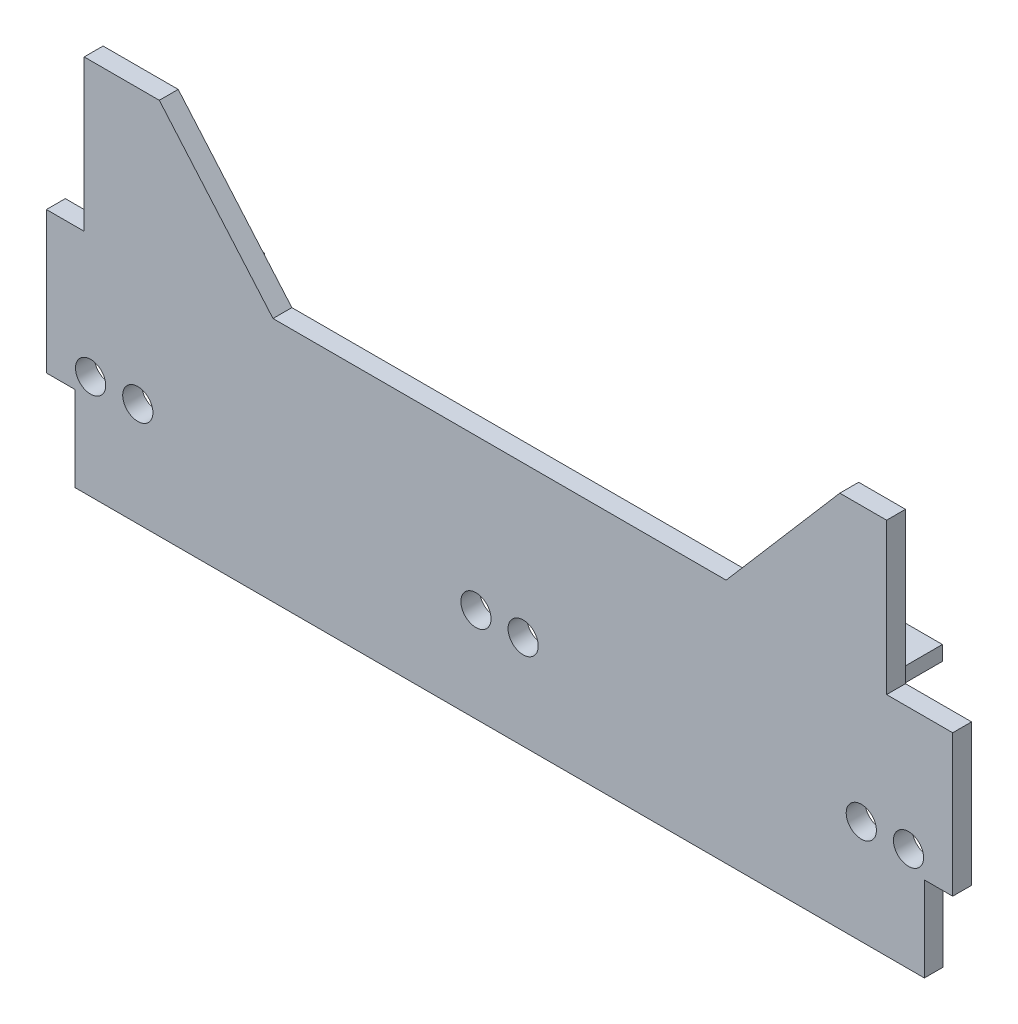
ISO-10303-21;
HEADER;
FILE_DESCRIPTION(('STEP AP214'),'2;1');
FILE_NAME('part.step','',(''),(''),'','','');
FILE_SCHEMA(('AUTOMOTIVE_DESIGN { 1 0 10303 214 1 1 1 1 }'));
ENDSEC;
DATA;
#1=APPLICATION_CONTEXT('core data for automotive mechanical design processes');
#2=APPLICATION_PROTOCOL_DEFINITION('international standard','automotive_design',2000,#1);
#3=PRODUCT_CONTEXT('',#1,'mechanical');
#4=PRODUCT('Part','Part','',(#3));
#5=PRODUCT_RELATED_PRODUCT_CATEGORY('part','',(#4));
#6=PRODUCT_DEFINITION_FORMATION('','',#4);
#7=PRODUCT_DEFINITION_CONTEXT('part definition',#1,'design');
#8=PRODUCT_DEFINITION('design','',#6,#7);
#9=PRODUCT_DEFINITION_SHAPE('','',#8);
#10=(LENGTH_UNIT() NAMED_UNIT(*) SI_UNIT(.MILLI.,.METRE.));
#11=(NAMED_UNIT(*) PLANE_ANGLE_UNIT() SI_UNIT($,.RADIAN.));
#12=(NAMED_UNIT(*) SI_UNIT($,.STERADIAN.) SOLID_ANGLE_UNIT());
#13=UNCERTAINTY_MEASURE_WITH_UNIT(LENGTH_MEASURE(1.E-05),#10,'distance_accuracy_value','');
#14=(GEOMETRIC_REPRESENTATION_CONTEXT(3) GLOBAL_UNCERTAINTY_ASSIGNED_CONTEXT((#13)) GLOBAL_UNIT_ASSIGNED_CONTEXT((#10,
#11,#12)) REPRESENTATION_CONTEXT('',''));
#15=CARTESIAN_POINT('',(0.,0.,0.));
#16=DIRECTION('',(0.,0.,1.));
#17=DIRECTION('',(1.,0.,0.));
#18=AXIS2_PLACEMENT_3D('',#15,#16,#17);
#19=CARTESIAN_POINT('',(-240.,100.,10.));
#20=DIRECTION('',(0.,-1.,0.));
#21=DIRECTION('',(0.,0.,-1.));
#22=AXIS2_PLACEMENT_3D('',#19,#20,#21);
#23=PLANE('',#22);
#24=DIRECTION('',(-1.,0.,0.));
#25=VECTOR('',#24,1.);
#26=CARTESIAN_POINT('',(-240.,100.,10.));
#27=LINE('',#26,#25);
#28=CARTESIAN_POINT('',(205.,100.,10.));
#29=VERTEX_POINT('',#28);
#30=CARTESIAN_POINT('',(180.207027178981,100.,10.));
#31=VERTEX_POINT('',#30);
#32=EDGE_CURVE('E215',#29,#31,#27,.T.);
#33=ORIENTED_EDGE('',*,*,#32,.F.);
#34=DIRECTION('',(0.,0.,-1.));
#35=VECTOR('',#34,1.);
#36=CARTESIAN_POINT('',(205.,100.,10.));
#37=LINE('',#36,#35);
#38=CARTESIAN_POINT('',(205.,100.,0.));
#39=VERTEX_POINT('',#38);
#40=EDGE_CURVE('E395',#29,#39,#37,.T.);
#41=ORIENTED_EDGE('',*,*,#40,.T.);
#42=DIRECTION('',(-1.,0.,0.));
#43=VECTOR('',#42,1.);
#44=CARTESIAN_POINT('',(-240.,100.,0.));
#45=LINE('',#44,#43);
#46=CARTESIAN_POINT('',(180.207027178981,100.,0.));
#47=VERTEX_POINT('',#46);
#48=EDGE_CURVE('E227',#39,#47,#45,.T.);
#49=ORIENTED_EDGE('',*,*,#48,.T.);
#50=DIRECTION('',(0.,0.,-1.));
#51=VECTOR('',#50,1.);
#52=CARTESIAN_POINT('',(180.207027178981,100.,10.));
#53=LINE('',#52,#51);
#54=EDGE_CURVE('E367',#31,#47,#53,.T.);
#55=ORIENTED_EDGE('',*,*,#54,.F.);
#56=EDGE_LOOP('',(#33,#41,#49,#55));
#57=FACE_BOUND('',#56,.T.);
#58=ADVANCED_FACE('F33',(#57),#23,.F.);
#59=CARTESIAN_POINT('',(0.,0.,0.));
#60=DIRECTION('',(0.,0.,-1.));
#61=DIRECTION('',(-1.,0.,0.));
#62=AXIS2_PLACEMENT_3D('',#59,#60,#61);
#63=PLANE('',#62);
#64=DIRECTION('',(0.,-1.,0.));
#65=VECTOR('',#64,1.);
#66=CARTESIAN_POINT('',(-225.,-100.,0.));
#67=LINE('',#66,#65);
#68=CARTESIAN_POINT('',(-225.,-55.,0.));
#69=VERTEX_POINT('',#68);
#70=CARTESIAN_POINT('',(-225.,-100.,0.));
#71=VERTEX_POINT('',#70);
#72=EDGE_CURVE('E203',#69,#71,#67,.T.);
#73=ORIENTED_EDGE('',*,*,#72,.F.);
#74=DIRECTION('',(1.,0.,0.));
#75=VECTOR('',#74,1.);
#76=CARTESIAN_POINT('',(-240.,-55.,0.));
#77=LINE('',#76,#75);
#78=CARTESIAN_POINT('',(-240.,-55.,0.));
#79=VERTEX_POINT('',#78);
#80=EDGE_CURVE('E413',#79,#69,#77,.T.);
#81=ORIENTED_EDGE('',*,*,#80,.F.);
#82=DIRECTION('',(0.,-1.,0.));
#83=VECTOR('',#82,1.);
#84=CARTESIAN_POINT('',(-240.,-100.,0.));
#85=LINE('',#84,#83);
#86=CARTESIAN_POINT('',(-240.,20.,0.));
#87=VERTEX_POINT('',#86);
#88=EDGE_CURVE('E211',#87,#79,#85,.T.);
#89=ORIENTED_EDGE('',*,*,#88,.F.);
#90=DIRECTION('',(-1.,0.,0.));
#91=VECTOR('',#90,1.);
#92=CARTESIAN_POINT('',(-240.,20.,0.));
#93=LINE('',#92,#91);
#94=CARTESIAN_POINT('',(-220.,20.,0.));
#95=VERTEX_POINT('',#94);
#96=EDGE_CURVE('E414',#95,#87,#93,.T.);
#97=ORIENTED_EDGE('',*,*,#96,.F.);
#98=DIRECTION('',(0.,-1.,0.));
#99=VECTOR('',#98,1.);
#100=CARTESIAN_POINT('',(-220.,20.,0.));
#101=LINE('',#100,#99);
#102=CARTESIAN_POINT('',(-220.,100.,0.));
#103=VERTEX_POINT('',#102);
#104=EDGE_CURVE('E398',#103,#95,#101,.T.);
#105=ORIENTED_EDGE('',*,*,#104,.F.);
#106=CARTESIAN_POINT('',(-180.207027178981,100.,0.));
#107=VERTEX_POINT('',#106);
#108=EDGE_CURVE('E225',#107,#103,#45,.T.);
#109=ORIENTED_EDGE('',*,*,#108,.F.);
#110=DIRECTION('',(-0.652083018675862,0.758147569246631,0.));
#111=VECTOR('',#110,1.);
#112=CARTESIAN_POINT('',(-180.207027178981,100.,0.));
#113=LINE('',#112,#111);
#114=CARTESIAN_POINT('',(-120.,30.,0.));
#115=VERTEX_POINT('',#114);
#116=EDGE_CURVE('E373',#115,#107,#113,.T.);
#117=ORIENTED_EDGE('',*,*,#116,.F.);
#118=DIRECTION('',(-1.,0.,0.));
#119=VECTOR('',#118,1.);
#120=CARTESIAN_POINT('',(0.,30.,0.));
#121=LINE('',#120,#119);
#122=CARTESIAN_POINT('',(120.,30.,0.));
#123=VERTEX_POINT('',#122);
#124=EDGE_CURVE('E324',#123,#115,#121,.T.);
#125=ORIENTED_EDGE('',*,*,#124,.F.);
#126=DIRECTION('',(-0.652083018675862,-0.758147569246631,0.));
#127=VECTOR('',#126,1.);
#128=CARTESIAN_POINT('',(180.207027178981,100.,0.));
#129=LINE('',#128,#127);
#130=EDGE_CURVE('E374',#47,#123,#129,.T.);
#131=ORIENTED_EDGE('',*,*,#130,.F.);
#132=ORIENTED_EDGE('',*,*,#48,.F.);
#133=DIRECTION('',(0.,1.,0.));
#134=VECTOR('',#133,1.);
#135=CARTESIAN_POINT('',(205.,20.,0.));
#136=LINE('',#135,#134);
#137=CARTESIAN_POINT('',(205.,20.,0.));
#138=VERTEX_POINT('',#137);
#139=EDGE_CURVE('E399',#138,#39,#136,.T.);
#140=ORIENTED_EDGE('',*,*,#139,.F.);
#141=DIRECTION('',(-1.,0.,0.));
#142=VECTOR('',#141,1.);
#143=CARTESIAN_POINT('',(240.,20.,0.));
#144=LINE('',#143,#142);
#145=CARTESIAN_POINT('',(240.,20.,0.));
#146=VERTEX_POINT('',#145);
#147=EDGE_CURVE('E386',#146,#138,#144,.T.);
#148=ORIENTED_EDGE('',*,*,#147,.F.);
#149=DIRECTION('',(0.,1.,0.));
#150=VECTOR('',#149,1.);
#151=CARTESIAN_POINT('',(240.,-100.,0.));
#152=LINE('',#151,#150);
#153=CARTESIAN_POINT('',(240.,-55.,0.));
#154=VERTEX_POINT('',#153);
#155=EDGE_CURVE('E222',#154,#146,#152,.T.);
#156=ORIENTED_EDGE('',*,*,#155,.F.);
#157=DIRECTION('',(1.,0.,0.));
#158=VECTOR('',#157,1.);
#159=CARTESIAN_POINT('',(240.,-55.,0.));
#160=LINE('',#159,#158);
#161=CARTESIAN_POINT('',(225.,-55.,0.));
#162=VERTEX_POINT('',#161);
#163=EDGE_CURVE('E357',#162,#154,#160,.T.);
#164=ORIENTED_EDGE('',*,*,#163,.F.);
#165=DIRECTION('',(0.,1.,0.));
#166=VECTOR('',#165,1.);
#167=CARTESIAN_POINT('',(225.,-100.,0.));
#168=LINE('',#167,#166);
#169=CARTESIAN_POINT('',(225.,-100.,0.));
#170=VERTEX_POINT('',#169);
#171=EDGE_CURVE('E360',#170,#162,#168,.T.);
#172=ORIENTED_EDGE('',*,*,#171,.F.);
#173=DIRECTION('',(1.,0.,0.));
#174=VECTOR('',#173,1.);
#175=CARTESIAN_POINT('',(-240.,-100.,0.));
#176=LINE('',#175,#174);
#177=EDGE_CURVE('E230',#71,#170,#176,.T.);
#178=ORIENTED_EDGE('',*,*,#177,.F.);
#179=EDGE_LOOP('',(#73,#81,#89,#97,#105,#109,#117,#125,#131,#132,#140,#148,#156,#164,#172,#178));
#180=FACE_BOUND('',#179,.T.);
#181=CARTESIAN_POINT('',(216.6,-45.,0.));
#182=DIRECTION('',(0.,0.,-1.));
#183=DIRECTION('',(-1.,0.,0.));
#184=AXIS2_PLACEMENT_3D('',#181,#182,#183);
#185=CIRCLE('',#184,7.99999999999998);
#186=CARTESIAN_POINT('',(208.6,-45.,0.));
#187=VERTEX_POINT('',#186);
#188=EDGE_CURVE('E315',#187,#187,#185,.T.);
#189=ORIENTED_EDGE('',*,*,#188,.F.);
#190=EDGE_LOOP('',(#189));
#191=FACE_BOUND('',#190,.T.);
#192=CARTESIAN_POINT('',(191.6,-45.,0.));
#193=DIRECTION('',(0.,0.,-1.));
#194=DIRECTION('',(-1.,0.,0.));
#195=AXIS2_PLACEMENT_3D('',#192,#193,#194);
#196=CIRCLE('',#195,8.00000000000001);
#197=CARTESIAN_POINT('',(183.6,-45.,0.));
#198=VERTEX_POINT('',#197);
#199=EDGE_CURVE('E318',#198,#198,#196,.T.);
#200=ORIENTED_EDGE('',*,*,#199,.F.);
#201=EDGE_LOOP('',(#200));
#202=FACE_BOUND('',#201,.T.);
#203=CARTESIAN_POINT('',(12.5,-50.,0.));
#204=DIRECTION('',(0.,0.,-1.));
#205=DIRECTION('',(-1.,0.,0.));
#206=AXIS2_PLACEMENT_3D('',#203,#204,#205);
#207=CIRCLE('',#206,8.);
#208=CARTESIAN_POINT('',(4.5,-50.,0.));
#209=VERTEX_POINT('',#208);
#210=EDGE_CURVE('E321',#209,#209,#207,.T.);
#211=ORIENTED_EDGE('',*,*,#210,.F.);
#212=EDGE_LOOP('',(#211));
#213=FACE_BOUND('',#212,.T.);
#214=CARTESIAN_POINT('',(-191.6,-45.,0.));
#215=DIRECTION('',(0.,0.,-1.));
#216=DIRECTION('',(-1.,0.,0.));
#217=AXIS2_PLACEMENT_3D('',#214,#215,#216);
#218=CIRCLE('',#217,8.00000000000001);
#219=CARTESIAN_POINT('',(-199.6,-45.,0.));
#220=VERTEX_POINT('',#219);
#221=EDGE_CURVE('E326',#220,#220,#218,.T.);
#222=ORIENTED_EDGE('',*,*,#221,.F.);
#223=EDGE_LOOP('',(#222));
#224=FACE_BOUND('',#223,.T.);
#225=CARTESIAN_POINT('',(-216.6,-45.,0.));
#226=DIRECTION('',(0.,0.,-1.));
#227=DIRECTION('',(-1.,0.,0.));
#228=AXIS2_PLACEMENT_3D('',#225,#226,#227);
#229=CIRCLE('',#228,8.00000000000001);
#230=CARTESIAN_POINT('',(-224.6,-45.,0.));
#231=VERTEX_POINT('',#230);
#232=EDGE_CURVE('E329',#231,#231,#229,.T.);
#233=ORIENTED_EDGE('',*,*,#232,.F.);
#234=EDGE_LOOP('',(#233));
#235=FACE_BOUND('',#234,.T.);
#236=CARTESIAN_POINT('',(-12.5,-50.,0.));
#237=DIRECTION('',(0.,0.,-1.));
#238=DIRECTION('',(-1.,0.,0.));
#239=AXIS2_PLACEMENT_3D('',#236,#237,#238);
#240=CIRCLE('',#239,8.);
#241=CARTESIAN_POINT('',(-20.5,-50.,0.));
#242=VERTEX_POINT('',#241);
#243=EDGE_CURVE('E309',#242,#242,#240,.T.);
#244=ORIENTED_EDGE('',*,*,#243,.F.);
#245=EDGE_LOOP('',(#244));
#246=FACE_BOUND('',#245,.T.);
#247=DIRECTION('',(-1.,0.,0.));
#248=VECTOR('',#247,1.);
#249=CARTESIAN_POINT('',(194.555,9.99999999999999,0.));
#250=LINE('',#249,#248);
#251=CARTESIAN_POINT('',(194.555,9.99999999999999,0.));
#252=VERTEX_POINT('',#251);
#253=CARTESIAN_POINT('',(164.555,10.,0.));
#254=VERTEX_POINT('',#253);
#255=EDGE_CURVE('E259',#252,#254,#250,.T.);
#256=ORIENTED_EDGE('',*,*,#255,.F.);
#257=DIRECTION('',(0.,-1.,0.));
#258=VECTOR('',#257,1.);
#259=CARTESIAN_POINT('',(194.555,17.7613800165879,0.));
#260=LINE('',#259,#258);
#261=CARTESIAN_POINT('',(194.555,17.7613800165879,0.));
#262=VERTEX_POINT('',#261);
#263=EDGE_CURVE('E261',#262,#252,#260,.T.);
#264=ORIENTED_EDGE('',*,*,#263,.F.);
#265=DIRECTION('',(1.,0.,0.));
#266=VECTOR('',#265,1.);
#267=CARTESIAN_POINT('',(194.555,17.7613800165879,0.));
#268=LINE('',#267,#266);
#269=CARTESIAN_POINT('',(164.555,17.7613800165879,0.));
#270=VERTEX_POINT('',#269);
#271=EDGE_CURVE('E253',#270,#262,#268,.T.);
#272=ORIENTED_EDGE('',*,*,#271,.F.);
#273=DIRECTION('',(0.,1.,0.));
#274=VECTOR('',#273,1.);
#275=CARTESIAN_POINT('',(164.555,17.7613800165879,0.));
#276=LINE('',#275,#274);
#277=EDGE_CURVE('E256',#254,#270,#276,.T.);
#278=ORIENTED_EDGE('',*,*,#277,.F.);
#279=EDGE_LOOP('',(#256,#264,#272,#278));
#280=FACE_BOUND('',#279,.T.);
#281=DIRECTION('',(0.,-1.,0.));
#282=VECTOR('',#281,1.);
#283=CARTESIAN_POINT('',(-164.555,17.7613800165879,0.));
#284=LINE('',#283,#282);
#285=CARTESIAN_POINT('',(-164.555,17.7613800165879,0.));
#286=VERTEX_POINT('',#285);
#287=CARTESIAN_POINT('',(-164.555,10.,0.));
#288=VERTEX_POINT('',#287);
#289=EDGE_CURVE('E288',#286,#288,#284,.T.);
#290=ORIENTED_EDGE('',*,*,#289,.F.);
#291=DIRECTION('',(1.,0.,0.));
#292=VECTOR('',#291,1.);
#293=CARTESIAN_POINT('',(-194.555,17.7613800165879,0.));
#294=LINE('',#293,#292);
#295=CARTESIAN_POINT('',(-194.555,17.7613800165879,0.));
#296=VERTEX_POINT('',#295);
#297=EDGE_CURVE('E290',#296,#286,#294,.T.);
#298=ORIENTED_EDGE('',*,*,#297,.F.);
#299=DIRECTION('',(0.,1.,0.));
#300=VECTOR('',#299,1.);
#301=CARTESIAN_POINT('',(-194.555,17.7613800165879,0.));
#302=LINE('',#301,#300);
#303=CARTESIAN_POINT('',(-194.555,10.,0.));
#304=VERTEX_POINT('',#303);
#305=EDGE_CURVE('E282',#304,#296,#302,.T.);
#306=ORIENTED_EDGE('',*,*,#305,.F.);
#307=DIRECTION('',(-1.,0.,0.));
#308=VECTOR('',#307,1.);
#309=CARTESIAN_POINT('',(-194.555,10.,0.));
#310=LINE('',#309,#308);
#311=EDGE_CURVE('E285',#288,#304,#310,.T.);
#312=ORIENTED_EDGE('',*,*,#311,.F.);
#313=EDGE_LOOP('',(#290,#298,#306,#312));
#314=FACE_BOUND('',#313,.T.);
#315=ADVANCED_FACE('F435',(#180,#191,#202,#213,#224,#235,#246,#280,#314),#63,.T.);
#316=CARTESIAN_POINT('',(240.,-100.,10.));
#317=DIRECTION('',(-1.,0.,0.));
#318=DIRECTION('',(0.,0.,1.));
#319=AXIS2_PLACEMENT_3D('',#316,#317,#318);
#320=PLANE('',#319);
#321=ORIENTED_EDGE('',*,*,#155,.T.);
#322=DIRECTION('',(0.,0.,-1.));
#323=VECTOR('',#322,1.);
#324=CARTESIAN_POINT('',(240.,20.,10.));
#325=LINE('',#324,#323);
#326=CARTESIAN_POINT('',(240.,20.,10.));
#327=VERTEX_POINT('',#326);
#328=EDGE_CURVE('E390',#327,#146,#325,.T.);
#329=ORIENTED_EDGE('',*,*,#328,.F.);
#330=DIRECTION('',(0.,1.,0.));
#331=VECTOR('',#330,1.);
#332=CARTESIAN_POINT('',(240.,-100.,10.));
#333=LINE('',#332,#331);
#334=CARTESIAN_POINT('',(240.,-55.,10.));
#335=VERTEX_POINT('',#334);
#336=EDGE_CURVE('E231',#335,#327,#333,.T.);
#337=ORIENTED_EDGE('',*,*,#336,.F.);
#338=DIRECTION('',(0.,0.,-1.));
#339=VECTOR('',#338,1.);
#340=CARTESIAN_POINT('',(240.,-55.,10.));
#341=LINE('',#340,#339);
#342=EDGE_CURVE('E345',#335,#154,#341,.T.);
#343=ORIENTED_EDGE('',*,*,#342,.T.);
#344=EDGE_LOOP('',(#321,#329,#337,#343));
#345=FACE_BOUND('',#344,.T.);
#346=ADVANCED_FACE('F35',(#345),#320,.F.);
#347=ORIENTED_EDGE('',*,*,#108,.T.);
#348=DIRECTION('',(0.,0.,-1.));
#349=VECTOR('',#348,1.);
#350=CARTESIAN_POINT('',(-220.,100.,10.));
#351=LINE('',#350,#349);
#352=CARTESIAN_POINT('',(-220.,100.,10.));
#353=VERTEX_POINT('',#352);
#354=EDGE_CURVE('E407',#353,#103,#351,.T.);
#355=ORIENTED_EDGE('',*,*,#354,.F.);
#356=CARTESIAN_POINT('',(-180.207027178981,100.,10.));
#357=VERTEX_POINT('',#356);
#358=EDGE_CURVE('E218',#357,#353,#27,.T.);
#359=ORIENTED_EDGE('',*,*,#358,.F.);
#360=DIRECTION('',(0.,0.,-1.));
#361=VECTOR('',#360,1.);
#362=CARTESIAN_POINT('',(-180.207027178981,100.,10.));
#363=LINE('',#362,#361);
#364=EDGE_CURVE('E382',#357,#107,#363,.T.);
#365=ORIENTED_EDGE('',*,*,#364,.T.);
#366=EDGE_LOOP('',(#347,#355,#359,#365));
#367=FACE_BOUND('',#366,.T.);
#368=ADVANCED_FACE('F468',(#367),#23,.F.);
#369=CARTESIAN_POINT('',(-240.,-100.,10.));
#370=DIRECTION('',(1.,0.,0.));
#371=DIRECTION('',(0.,0.,-1.));
#372=AXIS2_PLACEMENT_3D('',#369,#370,#371);
#373=PLANE('',#372);
#374=ORIENTED_EDGE('',*,*,#88,.T.);
#375=DIRECTION('',(0.,0.,-1.));
#376=VECTOR('',#375,1.);
#377=CARTESIAN_POINT('',(-240.,-55.,10.));
#378=LINE('',#377,#376);
#379=CARTESIAN_POINT('',(-240.,-55.,10.));
#380=VERTEX_POINT('',#379);
#381=EDGE_CURVE('E198',#380,#79,#378,.T.);
#382=ORIENTED_EDGE('',*,*,#381,.F.);
#383=DIRECTION('',(0.,-1.,0.));
#384=VECTOR('',#383,1.);
#385=CARTESIAN_POINT('',(-240.,-100.,10.));
#386=LINE('',#385,#384);
#387=CARTESIAN_POINT('',(-240.,20.,10.));
#388=VERTEX_POINT('',#387);
#389=EDGE_CURVE('E42',#388,#380,#386,.T.);
#390=ORIENTED_EDGE('',*,*,#389,.F.);
#391=DIRECTION('',(0.,0.,-1.));
#392=VECTOR('',#391,1.);
#393=CARTESIAN_POINT('',(-240.,20.,10.));
#394=LINE('',#393,#392);
#395=EDGE_CURVE('E411',#388,#87,#394,.T.);
#396=ORIENTED_EDGE('',*,*,#395,.T.);
#397=EDGE_LOOP('',(#374,#382,#390,#396));
#398=FACE_BOUND('',#397,.T.);
#399=ADVANCED_FACE('F208',(#398),#373,.F.);
#400=CARTESIAN_POINT('',(-240.,-100.,10.));
#401=DIRECTION('',(0.,1.,0.));
#402=DIRECTION('',(0.,0.,1.));
#403=AXIS2_PLACEMENT_3D('',#400,#401,#402);
#404=PLANE('',#403);
#405=DIRECTION('',(1.,0.,0.));
#406=VECTOR('',#405,1.);
#407=CARTESIAN_POINT('',(-240.,-100.,10.));
#408=LINE('',#407,#406);
#409=CARTESIAN_POINT('',(-225.,-100.,10.));
#410=VERTEX_POINT('',#409);
#411=CARTESIAN_POINT('',(225.,-100.,10.));
#412=VERTEX_POINT('',#411);
#413=EDGE_CURVE('E11',#410,#412,#408,.T.);
#414=ORIENTED_EDGE('',*,*,#413,.F.);
#415=DIRECTION('',(0.,0.,-1.));
#416=VECTOR('',#415,1.);
#417=CARTESIAN_POINT('',(-225.,-100.,10.));
#418=LINE('',#417,#416);
#419=EDGE_CURVE('E363',#410,#71,#418,.T.);
#420=ORIENTED_EDGE('',*,*,#419,.T.);
#421=ORIENTED_EDGE('',*,*,#177,.T.);
#422=DIRECTION('',(0.,0.,-1.));
#423=VECTOR('',#422,1.);
#424=CARTESIAN_POINT('',(225.,-100.,10.));
#425=LINE('',#424,#423);
#426=EDGE_CURVE('E350',#412,#170,#425,.T.);
#427=ORIENTED_EDGE('',*,*,#426,.F.);
#428=EDGE_LOOP('',(#414,#420,#421,#427));
#429=FACE_BOUND('',#428,.T.);
#430=ADVANCED_FACE('F427',(#429),#404,.F.);
#431=CARTESIAN_POINT('',(0.,0.,10.));
#432=DIRECTION('',(0.,0.,-1.));
#433=DIRECTION('',(-1.,0.,0.));
#434=AXIS2_PLACEMENT_3D('',#431,#432,#433);
#435=PLANE('',#434);
#436=CARTESIAN_POINT('',(216.6,-45.,10.));
#437=DIRECTION('',(0.,0.,1.));
#438=DIRECTION('',(-1.,0.,0.));
#439=AXIS2_PLACEMENT_3D('',#436,#437,#438);
#440=CIRCLE('',#439,7.99999999999998);
#441=CARTESIAN_POINT('',(208.6,-45.,10.));
#442=VERTEX_POINT('',#441);
#443=EDGE_CURVE('E341',#442,#442,#440,.T.);
#444=ORIENTED_EDGE('',*,*,#443,.F.);
#445=EDGE_LOOP('',(#444));
#446=FACE_BOUND('',#445,.T.);
#447=CARTESIAN_POINT('',(191.6,-45.,10.));
#448=DIRECTION('',(0.,0.,1.));
#449=DIRECTION('',(-1.,0.,0.));
#450=AXIS2_PLACEMENT_3D('',#447,#448,#449);
#451=CIRCLE('',#450,8.00000000000001);
#452=CARTESIAN_POINT('',(183.6,-45.,10.));
#453=VERTEX_POINT('',#452);
#454=EDGE_CURVE('E344',#453,#453,#451,.T.);
#455=ORIENTED_EDGE('',*,*,#454,.F.);
#456=EDGE_LOOP('',(#455));
#457=FACE_BOUND('',#456,.T.);
#458=CARTESIAN_POINT('',(12.5,-50.,10.));
#459=DIRECTION('',(0.,0.,1.));
#460=DIRECTION('',(-1.,0.,0.));
#461=AXIS2_PLACEMENT_3D('',#458,#459,#460);
#462=CIRCLE('',#461,8.);
#463=CARTESIAN_POINT('',(4.5,-50.,10.));
#464=VERTEX_POINT('',#463);
#465=EDGE_CURVE('E336',#464,#464,#462,.T.);
#466=ORIENTED_EDGE('',*,*,#465,.F.);
#467=EDGE_LOOP('',(#466));
#468=FACE_BOUND('',#467,.T.);
#469=CARTESIAN_POINT('',(-191.6,-45.,10.));
#470=DIRECTION('',(0.,0.,1.));
#471=DIRECTION('',(1.,0.,0.));
#472=AXIS2_PLACEMENT_3D('',#469,#470,#471);
#473=CIRCLE('',#472,8.00000000000001);
#474=CARTESIAN_POINT('',(-183.6,-45.,10.));
#475=VERTEX_POINT('',#474);
#476=EDGE_CURVE('E335',#475,#475,#473,.T.);
#477=ORIENTED_EDGE('',*,*,#476,.F.);
#478=EDGE_LOOP('',(#477));
#479=FACE_BOUND('',#478,.T.);
#480=CARTESIAN_POINT('',(-216.6,-45.,10.));
#481=DIRECTION('',(0.,0.,1.));
#482=DIRECTION('',(1.,0.,0.));
#483=AXIS2_PLACEMENT_3D('',#480,#481,#482);
#484=CIRCLE('',#483,8.00000000000001);
#485=CARTESIAN_POINT('',(-208.6,-45.,10.));
#486=VERTEX_POINT('',#485);
#487=EDGE_CURVE('E332',#486,#486,#484,.T.);
#488=ORIENTED_EDGE('',*,*,#487,.F.);
#489=EDGE_LOOP('',(#488));
#490=FACE_BOUND('',#489,.T.);
#491=CARTESIAN_POINT('',(-12.5,-50.,10.));
#492=DIRECTION('',(0.,0.,1.));
#493=DIRECTION('',(1.,0.,0.));
#494=AXIS2_PLACEMENT_3D('',#491,#492,#493);
#495=CIRCLE('',#494,8.);
#496=CARTESIAN_POINT('',(-4.5,-50.,10.));
#497=VERTEX_POINT('',#496);
#498=EDGE_CURVE('E312',#497,#497,#495,.T.);
#499=ORIENTED_EDGE('',*,*,#498,.F.);
#500=EDGE_LOOP('',(#499));
#501=FACE_BOUND('',#500,.T.);
#502=DIRECTION('',(1.,0.,0.));
#503=VECTOR('',#502,1.);
#504=CARTESIAN_POINT('',(-240.,-55.,10.));
#505=LINE('',#504,#503);
#506=CARTESIAN_POINT('',(-225.,-55.,10.));
#507=VERTEX_POINT('',#506);
#508=EDGE_CURVE('E194',#380,#507,#505,.T.);
#509=ORIENTED_EDGE('',*,*,#508,.T.);
#510=DIRECTION('',(0.,-1.,0.));
#511=VECTOR('',#510,1.);
#512=CARTESIAN_POINT('',(-225.,-100.,10.));
#513=LINE('',#512,#511);
#514=EDGE_CURVE('E50',#507,#410,#513,.T.);
#515=ORIENTED_EDGE('',*,*,#514,.T.);
#516=ORIENTED_EDGE('',*,*,#413,.T.);
#517=DIRECTION('',(0.,1.,0.));
#518=VECTOR('',#517,1.);
#519=CARTESIAN_POINT('',(225.,-100.,10.));
#520=LINE('',#519,#518);
#521=CARTESIAN_POINT('',(225.,-55.,10.));
#522=VERTEX_POINT('',#521);
#523=EDGE_CURVE('E359',#412,#522,#520,.T.);
#524=ORIENTED_EDGE('',*,*,#523,.T.);
#525=DIRECTION('',(1.,0.,0.));
#526=VECTOR('',#525,1.);
#527=CARTESIAN_POINT('',(240.,-55.,10.));
#528=LINE('',#527,#526);
#529=EDGE_CURVE('E353',#522,#335,#528,.T.);
#530=ORIENTED_EDGE('',*,*,#529,.T.);
#531=ORIENTED_EDGE('',*,*,#336,.T.);
#532=DIRECTION('',(-1.,0.,0.));
#533=VECTOR('',#532,1.);
#534=CARTESIAN_POINT('',(240.,20.,10.));
#535=LINE('',#534,#533);
#536=CARTESIAN_POINT('',(205.,20.,10.));
#537=VERTEX_POINT('',#536);
#538=EDGE_CURVE('E401',#327,#537,#535,.T.);
#539=ORIENTED_EDGE('',*,*,#538,.T.);
#540=DIRECTION('',(0.,1.,0.));
#541=VECTOR('',#540,1.);
#542=CARTESIAN_POINT('',(205.,20.,10.));
#543=LINE('',#542,#541);
#544=EDGE_CURVE('E393',#537,#29,#543,.T.);
#545=ORIENTED_EDGE('',*,*,#544,.T.);
#546=ORIENTED_EDGE('',*,*,#32,.T.);
#547=DIRECTION('',(-0.652083018675862,-0.758147569246631,0.));
#548=VECTOR('',#547,1.);
#549=CARTESIAN_POINT('',(180.207027178981,100.,10.));
#550=LINE('',#549,#548);
#551=CARTESIAN_POINT('',(120.,30.,10.));
#552=VERTEX_POINT('',#551);
#553=EDGE_CURVE('E370',#31,#552,#550,.T.);
#554=ORIENTED_EDGE('',*,*,#553,.T.);
#555=DIRECTION('',(1.,0.,0.));
#556=VECTOR('',#555,1.);
#557=CARTESIAN_POINT('',(-90.,30.,10.));
#558=LINE('',#557,#556);
#559=CARTESIAN_POINT('',(-120.,30.,10.));
#560=VERTEX_POINT('',#559);
#561=EDGE_CURVE('E333',#560,#552,#558,.T.);
#562=ORIENTED_EDGE('',*,*,#561,.F.);
#563=DIRECTION('',(-0.652083018675862,0.758147569246631,0.));
#564=VECTOR('',#563,1.);
#565=CARTESIAN_POINT('',(-180.207027178981,100.,10.));
#566=LINE('',#565,#564);
#567=EDGE_CURVE('E383',#560,#357,#566,.T.);
#568=ORIENTED_EDGE('',*,*,#567,.T.);
#569=ORIENTED_EDGE('',*,*,#358,.T.);
#570=DIRECTION('',(0.,-1.,0.));
#571=VECTOR('',#570,1.);
#572=CARTESIAN_POINT('',(-220.,20.,10.));
#573=LINE('',#572,#571);
#574=CARTESIAN_POINT('',(-220.,20.,10.));
#575=VERTEX_POINT('',#574);
#576=EDGE_CURVE('E416',#353,#575,#573,.T.);
#577=ORIENTED_EDGE('',*,*,#576,.T.);
#578=DIRECTION('',(-1.,0.,0.));
#579=VECTOR('',#578,1.);
#580=CARTESIAN_POINT('',(-240.,20.,10.));
#581=LINE('',#580,#579);
#582=EDGE_CURVE('E58',#575,#388,#581,.T.);
#583=ORIENTED_EDGE('',*,*,#582,.T.);
#584=ORIENTED_EDGE('',*,*,#389,.T.);
#585=EDGE_LOOP('',(#509,#515,#516,#524,#530,#531,#539,#545,#546,#554,#562,#568,#569,#577,#583,#584));
#586=FACE_BOUND('',#585,.T.);
#587=ADVANCED_FACE('F213',(#446,#457,#468,#479,#490,#501,#586),#435,.F.);
#588=CARTESIAN_POINT('',(194.555,17.7613800165879,-30.));
#589=DIRECTION('',(-1.,0.,0.));
#590=DIRECTION('',(0.,0.,1.));
#591=AXIS2_PLACEMENT_3D('',#588,#589,#590);
#592=PLANE('',#591);
#593=ORIENTED_EDGE('',*,*,#263,.T.);
#594=DIRECTION('',(0.,0.,1.));
#595=VECTOR('',#594,1.);
#596=CARTESIAN_POINT('',(194.555,9.99999999999999,-30.));
#597=LINE('',#596,#595);
#598=CARTESIAN_POINT('',(194.555,9.99999999999999,-30.));
#599=VERTEX_POINT('',#598);
#600=EDGE_CURVE('E226',#599,#252,#597,.T.);
#601=ORIENTED_EDGE('',*,*,#600,.F.);
#602=DIRECTION('',(0.,-1.,0.));
#603=VECTOR('',#602,1.);
#604=CARTESIAN_POINT('',(194.555,17.7613800165879,-30.));
#605=LINE('',#604,#603);
#606=CARTESIAN_POINT('',(194.555,17.7613800165879,-30.));
#607=VERTEX_POINT('',#606);
#608=EDGE_CURVE('E255',#607,#599,#605,.T.);
#609=ORIENTED_EDGE('',*,*,#608,.F.);
#610=DIRECTION('',(0.,0.,1.));
#611=VECTOR('',#610,1.);
#612=CARTESIAN_POINT('',(194.555,17.7613800165879,-30.));
#613=LINE('',#612,#611);
#614=EDGE_CURVE('E249',#607,#262,#613,.T.);
#615=ORIENTED_EDGE('',*,*,#614,.T.);
#616=EDGE_LOOP('',(#593,#601,#609,#615));
#617=FACE_BOUND('',#616,.T.);
#618=ADVANCED_FACE('F647',(#617),#592,.F.);
#619=CARTESIAN_POINT('',(194.555,9.99999999999999,-30.));
#620=DIRECTION('',(0.,1.,0.));
#621=DIRECTION('',(-1.,0.,0.));
#622=AXIS2_PLACEMENT_3D('',#619,#620,#621);
#623=PLANE('',#622);
#624=CARTESIAN_POINT('',(179.555,10.,-15.));
#625=DIRECTION('',(0.,1.,0.));
#626=DIRECTION('',(-1.,0.,0.));
#627=AXIS2_PLACEMENT_3D('',#624,#625,#626);
#628=CIRCLE('',#627,4.99999999999999);
#629=CARTESIAN_POINT('',(174.555,10.,-15.));
#630=VERTEX_POINT('',#629);
#631=EDGE_CURVE('E293',#630,#630,#628,.T.);
#632=ORIENTED_EDGE('',*,*,#631,.T.);
#633=EDGE_LOOP('',(#632));
#634=FACE_BOUND('',#633,.T.);
#635=ORIENTED_EDGE('',*,*,#255,.T.);
#636=DIRECTION('',(0.,0.,1.));
#637=VECTOR('',#636,1.);
#638=CARTESIAN_POINT('',(164.555,10.,-30.));
#639=LINE('',#638,#637);
#640=CARTESIAN_POINT('',(164.555,10.,-30.));
#641=VERTEX_POINT('',#640);
#642=EDGE_CURVE('E244',#641,#254,#639,.T.);
#643=ORIENTED_EDGE('',*,*,#642,.F.);
#644=DIRECTION('',(-1.,0.,0.));
#645=VECTOR('',#644,1.);
#646=CARTESIAN_POINT('',(194.555,9.99999999999999,-30.));
#647=LINE('',#646,#645);
#648=EDGE_CURVE('E268',#599,#641,#647,.T.);
#649=ORIENTED_EDGE('',*,*,#648,.F.);
#650=ORIENTED_EDGE('',*,*,#600,.T.);
#651=EDGE_LOOP('',(#635,#643,#649,#650));
#652=FACE_BOUND('',#651,.T.);
#653=ADVANCED_FACE('F642',(#634,#652),#623,.F.);
#654=CARTESIAN_POINT('',(164.555,17.7613800165879,-30.));
#655=DIRECTION('',(1.,0.,0.));
#656=DIRECTION('',(0.,0.,-1.));
#657=AXIS2_PLACEMENT_3D('',#654,#655,#656);
#658=PLANE('',#657);
#659=ORIENTED_EDGE('',*,*,#277,.T.);
#660=DIRECTION('',(0.,0.,1.));
#661=VECTOR('',#660,1.);
#662=CARTESIAN_POINT('',(164.555,17.7613800165879,-30.));
#663=LINE('',#662,#661);
#664=CARTESIAN_POINT('',(164.555,17.7613800165879,-30.));
#665=VERTEX_POINT('',#664);
#666=EDGE_CURVE('E247',#665,#270,#663,.T.);
#667=ORIENTED_EDGE('',*,*,#666,.F.);
#668=DIRECTION('',(0.,1.,0.));
#669=VECTOR('',#668,1.);
#670=CARTESIAN_POINT('',(164.555,17.7613800165879,-30.));
#671=LINE('',#670,#669);
#672=EDGE_CURVE('E266',#641,#665,#671,.T.);
#673=ORIENTED_EDGE('',*,*,#672,.F.);
#674=ORIENTED_EDGE('',*,*,#642,.T.);
#675=EDGE_LOOP('',(#659,#667,#673,#674));
#676=FACE_BOUND('',#675,.T.);
#677=ADVANCED_FACE('F634',(#676),#658,.F.);
#678=CARTESIAN_POINT('',(194.555,17.7613800165879,-30.));
#679=DIRECTION('',(0.,-1.,0.));
#680=DIRECTION('',(1.,0.,0.));
#681=AXIS2_PLACEMENT_3D('',#678,#679,#680);
#682=PLANE('',#681);
#683=CARTESIAN_POINT('',(179.555,17.7613800165879,-15.));
#684=DIRECTION('',(0.,1.,0.));
#685=DIRECTION('',(0.,0.,1.));
#686=AXIS2_PLACEMENT_3D('',#683,#684,#685);
#687=CIRCLE('',#686,4.99999999999999);
#688=CARTESIAN_POINT('',(179.555,17.7613800165879,-10.));
#689=VERTEX_POINT('',#688);
#690=EDGE_CURVE('E303',#689,#689,#687,.T.);
#691=ORIENTED_EDGE('',*,*,#690,.F.);
#692=EDGE_LOOP('',(#691));
#693=FACE_BOUND('',#692,.T.);
#694=ORIENTED_EDGE('',*,*,#271,.T.);
#695=ORIENTED_EDGE('',*,*,#614,.F.);
#696=DIRECTION('',(1.,0.,0.));
#697=VECTOR('',#696,1.);
#698=CARTESIAN_POINT('',(194.555,17.7613800165879,-30.));
#699=LINE('',#698,#697);
#700=EDGE_CURVE('E252',#665,#607,#699,.T.);
#701=ORIENTED_EDGE('',*,*,#700,.F.);
#702=ORIENTED_EDGE('',*,*,#666,.T.);
#703=EDGE_LOOP('',(#694,#695,#701,#702));
#704=FACE_BOUND('',#703,.T.);
#705=ADVANCED_FACE('F629',(#693,#704),#682,.F.);
#706=CARTESIAN_POINT('',(0.,0.,-30.));
#707=DIRECTION('',(0.,0.,-1.));
#708=DIRECTION('',(-1.,0.,0.));
#709=AXIS2_PLACEMENT_3D('',#706,#707,#708);
#710=PLANE('',#709);
#711=ORIENTED_EDGE('',*,*,#608,.T.);
#712=ORIENTED_EDGE('',*,*,#648,.T.);
#713=ORIENTED_EDGE('',*,*,#672,.T.);
#714=ORIENTED_EDGE('',*,*,#700,.T.);
#715=EDGE_LOOP('',(#711,#712,#713,#714));
#716=FACE_BOUND('',#715,.T.);
#717=ADVANCED_FACE('F621',(#716),#710,.T.);
#718=CARTESIAN_POINT('',(-194.555,17.7613800165879,-30.));
#719=DIRECTION('',(0.,-1.,0.));
#720=DIRECTION('',(1.,0.,0.));
#721=AXIS2_PLACEMENT_3D('',#718,#719,#720);
#722=PLANE('',#721);
#723=CARTESIAN_POINT('',(-179.555,17.7613800165879,-15.));
#724=DIRECTION('',(0.,1.,0.));
#725=DIRECTION('',(0.,0.,-1.));
#726=AXIS2_PLACEMENT_3D('',#723,#724,#725);
#727=CIRCLE('',#726,4.99999999999999);
#728=CARTESIAN_POINT('',(-179.555,17.7613800165879,-20.));
#729=VERTEX_POINT('',#728);
#730=EDGE_CURVE('E306',#729,#729,#727,.T.);
#731=ORIENTED_EDGE('',*,*,#730,.F.);
#732=EDGE_LOOP('',(#731));
#733=FACE_BOUND('',#732,.T.);
#734=ORIENTED_EDGE('',*,*,#297,.T.);
#735=DIRECTION('',(0.,0.,1.));
#736=VECTOR('',#735,1.);
#737=CARTESIAN_POINT('',(-164.555,17.7613800165879,-30.));
#738=LINE('',#737,#736);
#739=CARTESIAN_POINT('',(-164.555,17.7613800165879,-30.));
#740=VERTEX_POINT('',#739);
#741=EDGE_CURVE('E264',#740,#286,#738,.T.);
#742=ORIENTED_EDGE('',*,*,#741,.F.);
#743=DIRECTION('',(1.,0.,0.));
#744=VECTOR('',#743,1.);
#745=CARTESIAN_POINT('',(-194.555,17.7613800165879,-30.));
#746=LINE('',#745,#744);
#747=CARTESIAN_POINT('',(-194.555,17.7613800165879,-30.));
#748=VERTEX_POINT('',#747);
#749=EDGE_CURVE('E284',#748,#740,#746,.T.);
#750=ORIENTED_EDGE('',*,*,#749,.F.);
#751=DIRECTION('',(0.,0.,1.));
#752=VECTOR('',#751,1.);
#753=CARTESIAN_POINT('',(-194.555,17.7613800165879,-30.));
#754=LINE('',#753,#752);
#755=EDGE_CURVE('E278',#748,#296,#754,.T.);
#756=ORIENTED_EDGE('',*,*,#755,.T.);
#757=EDGE_LOOP('',(#734,#742,#750,#756));
#758=FACE_BOUND('',#757,.T.);
#759=ADVANCED_FACE('F616',(#733,#758),#722,.F.);
#760=CARTESIAN_POINT('',(-164.555,17.7613800165879,-30.));
#761=DIRECTION('',(-1.,0.,0.));
#762=DIRECTION('',(0.,0.,1.));
#763=AXIS2_PLACEMENT_3D('',#760,#761,#762);
#764=PLANE('',#763);
#765=ORIENTED_EDGE('',*,*,#289,.T.);
#766=DIRECTION('',(0.,0.,1.));
#767=VECTOR('',#766,1.);
#768=CARTESIAN_POINT('',(-164.555,10.,-30.));
#769=LINE('',#768,#767);
#770=CARTESIAN_POINT('',(-164.555,10.,-30.));
#771=VERTEX_POINT('',#770);
#772=EDGE_CURVE('E273',#771,#288,#769,.T.);
#773=ORIENTED_EDGE('',*,*,#772,.F.);
#774=DIRECTION('',(0.,-1.,0.));
#775=VECTOR('',#774,1.);
#776=CARTESIAN_POINT('',(-164.555,17.7613800165879,-30.));
#777=LINE('',#776,#775);
#778=EDGE_CURVE('E297',#740,#771,#777,.T.);
#779=ORIENTED_EDGE('',*,*,#778,.F.);
#780=ORIENTED_EDGE('',*,*,#741,.T.);
#781=EDGE_LOOP('',(#765,#773,#779,#780));
#782=FACE_BOUND('',#781,.T.);
#783=ADVANCED_FACE('F606',(#782),#764,.F.);
#784=CARTESIAN_POINT('',(-194.555,10.,-30.));
#785=DIRECTION('',(0.,1.,0.));
#786=DIRECTION('',(-1.,0.,0.));
#787=AXIS2_PLACEMENT_3D('',#784,#785,#786);
#788=PLANE('',#787);
#789=CARTESIAN_POINT('',(-179.555,10.,-15.));
#790=DIRECTION('',(0.,1.,0.));
#791=DIRECTION('',(-1.,0.,0.));
#792=AXIS2_PLACEMENT_3D('',#789,#790,#791);
#793=CIRCLE('',#792,4.99999999999999);
#794=CARTESIAN_POINT('',(-184.555,10.,-15.));
#795=VERTEX_POINT('',#794);
#796=EDGE_CURVE('E37',#795,#795,#793,.T.);
#797=ORIENTED_EDGE('',*,*,#796,.T.);
#798=EDGE_LOOP('',(#797));
#799=FACE_BOUND('',#798,.T.);
#800=ORIENTED_EDGE('',*,*,#311,.T.);
#801=DIRECTION('',(0.,0.,1.));
#802=VECTOR('',#801,1.);
#803=CARTESIAN_POINT('',(-194.555,10.,-30.));
#804=LINE('',#803,#802);
#805=CARTESIAN_POINT('',(-194.555,10.,-30.));
#806=VERTEX_POINT('',#805);
#807=EDGE_CURVE('E276',#806,#304,#804,.T.);
#808=ORIENTED_EDGE('',*,*,#807,.F.);
#809=DIRECTION('',(-1.,0.,0.));
#810=VECTOR('',#809,1.);
#811=CARTESIAN_POINT('',(-194.555,10.,-30.));
#812=LINE('',#811,#810);
#813=EDGE_CURVE('E295',#771,#806,#812,.T.);
#814=ORIENTED_EDGE('',*,*,#813,.F.);
#815=ORIENTED_EDGE('',*,*,#772,.T.);
#816=EDGE_LOOP('',(#800,#808,#814,#815));
#817=FACE_BOUND('',#816,.T.);
#818=ADVANCED_FACE('F600',(#799,#817),#788,.F.);
#819=CARTESIAN_POINT('',(-194.555,17.7613800165879,-30.));
#820=DIRECTION('',(1.,0.,0.));
#821=DIRECTION('',(0.,0.,-1.));
#822=AXIS2_PLACEMENT_3D('',#819,#820,#821);
#823=PLANE('',#822);
#824=ORIENTED_EDGE('',*,*,#305,.T.);
#825=ORIENTED_EDGE('',*,*,#755,.F.);
#826=DIRECTION('',(0.,1.,0.));
#827=VECTOR('',#826,1.);
#828=CARTESIAN_POINT('',(-194.555,17.7613800165879,-30.));
#829=LINE('',#828,#827);
#830=EDGE_CURVE('E281',#806,#748,#829,.T.);
#831=ORIENTED_EDGE('',*,*,#830,.F.);
#832=ORIENTED_EDGE('',*,*,#807,.T.);
#833=EDGE_LOOP('',(#824,#825,#831,#832));
#834=FACE_BOUND('',#833,.T.);
#835=ADVANCED_FACE('F605',(#834),#823,.F.);
#836=CARTESIAN_POINT('',(0.,0.,-30.));
#837=DIRECTION('',(0.,0.,-1.));
#838=DIRECTION('',(-1.,0.,0.));
#839=AXIS2_PLACEMENT_3D('',#836,#837,#838);
#840=PLANE('',#839);
#841=ORIENTED_EDGE('',*,*,#749,.T.);
#842=ORIENTED_EDGE('',*,*,#778,.T.);
#843=ORIENTED_EDGE('',*,*,#813,.T.);
#844=ORIENTED_EDGE('',*,*,#830,.T.);
#845=EDGE_LOOP('',(#841,#842,#843,#844));
#846=FACE_BOUND('',#845,.T.);
#847=ADVANCED_FACE('F592',(#846),#840,.T.);
#848=CARTESIAN_POINT('',(179.555,-12.2386199834121,-15.));
#849=DIRECTION('',(0.,1.,0.));
#850=DIRECTION('',(0.,0.,1.));
#851=AXIS2_PLACEMENT_3D('',#848,#849,#850);
#852=CYLINDRICAL_SURFACE('',#851,4.99999999999999);
#853=ORIENTED_EDGE('',*,*,#690,.T.);
#854=EDGE_LOOP('',(#853));
#855=FACE_BOUND('',#854,.T.);
#856=ORIENTED_EDGE('',*,*,#631,.F.);
#857=EDGE_LOOP('',(#856));
#858=FACE_BOUND('',#857,.T.);
#859=ADVANCED_FACE('F582',(#855,#858),#852,.F.);
#860=CARTESIAN_POINT('',(-179.555,-12.2386199834121,-15.));
#861=DIRECTION('',(0.,1.,0.));
#862=DIRECTION('',(0.,0.,1.));
#863=AXIS2_PLACEMENT_3D('',#860,#861,#862);
#864=CYLINDRICAL_SURFACE('',#863,4.99999999999999);
#865=ORIENTED_EDGE('',*,*,#730,.T.);
#866=EDGE_LOOP('',(#865));
#867=FACE_BOUND('',#866,.T.);
#868=ORIENTED_EDGE('',*,*,#796,.F.);
#869=EDGE_LOOP('',(#868));
#870=FACE_BOUND('',#869,.T.);
#871=ADVANCED_FACE('F573',(#867,#870),#864,.F.);
#872=CARTESIAN_POINT('',(-12.5,-50.,-20.));
#873=DIRECTION('',(0.,0.,1.));
#874=DIRECTION('',(1.,0.,0.));
#875=AXIS2_PLACEMENT_3D('',#872,#873,#874);
#876=CYLINDRICAL_SURFACE('',#875,8.);
#877=ORIENTED_EDGE('',*,*,#243,.T.);
#878=EDGE_LOOP('',(#877));
#879=FACE_BOUND('',#878,.T.);
#880=ORIENTED_EDGE('',*,*,#498,.T.);
#881=EDGE_LOOP('',(#880));
#882=FACE_BOUND('',#881,.T.);
#883=ADVANCED_FACE('F564',(#879,#882),#876,.F.);
#884=CARTESIAN_POINT('',(-216.6,-45.,-20.));
#885=DIRECTION('',(0.,0.,1.));
#886=DIRECTION('',(1.,0.,0.));
#887=AXIS2_PLACEMENT_3D('',#884,#885,#886);
#888=CYLINDRICAL_SURFACE('',#887,8.00000000000001);
#889=ORIENTED_EDGE('',*,*,#232,.T.);
#890=EDGE_LOOP('',(#889));
#891=FACE_BOUND('',#890,.T.);
#892=ORIENTED_EDGE('',*,*,#487,.T.);
#893=EDGE_LOOP('',(#892));
#894=FACE_BOUND('',#893,.T.);
#895=ADVANCED_FACE('F554',(#891,#894),#888,.F.);
#896=CARTESIAN_POINT('',(-191.6,-45.,-20.));
#897=DIRECTION('',(0.,0.,1.));
#898=DIRECTION('',(1.,0.,0.));
#899=AXIS2_PLACEMENT_3D('',#896,#897,#898);
#900=CYLINDRICAL_SURFACE('',#899,8.00000000000001);
#901=ORIENTED_EDGE('',*,*,#221,.T.);
#902=EDGE_LOOP('',(#901));
#903=FACE_BOUND('',#902,.T.);
#904=ORIENTED_EDGE('',*,*,#476,.T.);
#905=EDGE_LOOP('',(#904));
#906=FACE_BOUND('',#905,.T.);
#907=ADVANCED_FACE('F549',(#903,#906),#900,.F.);
#908=CARTESIAN_POINT('',(-90.,30.,-20.));
#909=DIRECTION('',(0.,-1.,0.));
#910=DIRECTION('',(1.,0.,0.));
#911=AXIS2_PLACEMENT_3D('',#908,#909,#910);
#912=PLANE('',#911);
#913=ORIENTED_EDGE('',*,*,#124,.T.);
#914=DIRECTION('',(0.,0.,-1.));
#915=VECTOR('',#914,1.);
#916=CARTESIAN_POINT('',(-120.,30.,10.));
#917=LINE('',#916,#915);
#918=EDGE_CURVE('E379',#560,#115,#917,.T.);
#919=ORIENTED_EDGE('',*,*,#918,.F.);
#920=ORIENTED_EDGE('',*,*,#561,.T.);
#921=DIRECTION('',(0.,0.,-1.));
#922=VECTOR('',#921,1.);
#923=CARTESIAN_POINT('',(120.,30.,10.));
#924=LINE('',#923,#922);
#925=EDGE_CURVE('E369',#552,#123,#924,.T.);
#926=ORIENTED_EDGE('',*,*,#925,.T.);
#927=EDGE_LOOP('',(#913,#919,#920,#926));
#928=FACE_BOUND('',#927,.T.);
#929=ADVANCED_FACE('F459',(#928),#912,.F.);
#930=CARTESIAN_POINT('',(12.5,-50.,-20.));
#931=DIRECTION('',(0.,0.,1.));
#932=DIRECTION('',(1.,0.,0.));
#933=AXIS2_PLACEMENT_3D('',#930,#931,#932);
#934=CYLINDRICAL_SURFACE('',#933,8.);
#935=ORIENTED_EDGE('',*,*,#210,.T.);
#936=EDGE_LOOP('',(#935));
#937=FACE_BOUND('',#936,.T.);
#938=ORIENTED_EDGE('',*,*,#465,.T.);
#939=EDGE_LOOP('',(#938));
#940=FACE_BOUND('',#939,.T.);
#941=ADVANCED_FACE('F532',(#937,#940),#934,.F.);
#942=CARTESIAN_POINT('',(191.6,-45.,-20.));
#943=DIRECTION('',(0.,0.,1.));
#944=DIRECTION('',(1.,0.,0.));
#945=AXIS2_PLACEMENT_3D('',#942,#943,#944);
#946=CYLINDRICAL_SURFACE('',#945,8.00000000000001);
#947=ORIENTED_EDGE('',*,*,#199,.T.);
#948=EDGE_LOOP('',(#947));
#949=FACE_BOUND('',#948,.T.);
#950=ORIENTED_EDGE('',*,*,#454,.T.);
#951=EDGE_LOOP('',(#950));
#952=FACE_BOUND('',#951,.T.);
#953=ADVANCED_FACE('F520',(#949,#952),#946,.F.);
#954=CARTESIAN_POINT('',(216.6,-45.,-20.));
#955=DIRECTION('',(0.,0.,1.));
#956=DIRECTION('',(1.,0.,0.));
#957=AXIS2_PLACEMENT_3D('',#954,#955,#956);
#958=CYLINDRICAL_SURFACE('',#957,7.99999999999998);
#959=ORIENTED_EDGE('',*,*,#188,.T.);
#960=EDGE_LOOP('',(#959));
#961=FACE_BOUND('',#960,.T.);
#962=ORIENTED_EDGE('',*,*,#443,.T.);
#963=EDGE_LOOP('',(#962));
#964=FACE_BOUND('',#963,.T.);
#965=ADVANCED_FACE('F515',(#961,#964),#958,.F.);
#966=CARTESIAN_POINT('',(240.,-55.,10.));
#967=DIRECTION('',(0.,1.,0.));
#968=DIRECTION('',(0.,0.,1.));
#969=AXIS2_PLACEMENT_3D('',#966,#967,#968);
#970=PLANE('',#969);
#971=ORIENTED_EDGE('',*,*,#163,.T.);
#972=ORIENTED_EDGE('',*,*,#342,.F.);
#973=ORIENTED_EDGE('',*,*,#529,.F.);
#974=DIRECTION('',(0.,0.,-1.));
#975=VECTOR('',#974,1.);
#976=CARTESIAN_POINT('',(225.,-55.,10.));
#977=LINE('',#976,#975);
#978=EDGE_CURVE('E352',#522,#162,#977,.T.);
#979=ORIENTED_EDGE('',*,*,#978,.T.);
#980=EDGE_LOOP('',(#971,#972,#973,#979));
#981=FACE_BOUND('',#980,.T.);
#982=ADVANCED_FACE('F440',(#981),#970,.F.);
#983=CARTESIAN_POINT('',(225.,-100.,10.));
#984=DIRECTION('',(-1.,0.,0.));
#985=DIRECTION('',(0.,0.,1.));
#986=AXIS2_PLACEMENT_3D('',#983,#984,#985);
#987=PLANE('',#986);
#988=ORIENTED_EDGE('',*,*,#171,.T.);
#989=ORIENTED_EDGE('',*,*,#978,.F.);
#990=ORIENTED_EDGE('',*,*,#523,.F.);
#991=ORIENTED_EDGE('',*,*,#426,.T.);
#992=EDGE_LOOP('',(#988,#989,#990,#991));
#993=FACE_BOUND('',#992,.T.);
#994=ADVANCED_FACE('F430',(#993),#987,.F.);
#995=CARTESIAN_POINT('',(-180.207027178981,100.,10.));
#996=DIRECTION('',(-0.758147569246631,-0.652083018675862,0.));
#997=DIRECTION('',(0.652083018675862,-0.758147569246631,0.));
#998=AXIS2_PLACEMENT_3D('',#995,#996,#997);
#999=PLANE('',#998);
#1000=ORIENTED_EDGE('',*,*,#116,.T.);
#1001=ORIENTED_EDGE('',*,*,#364,.F.);
#1002=ORIENTED_EDGE('',*,*,#567,.F.);
#1003=ORIENTED_EDGE('',*,*,#918,.T.);
#1004=EDGE_LOOP('',(#1000,#1001,#1002,#1003));
#1005=FACE_BOUND('',#1004,.T.);
#1006=ADVANCED_FACE('F463',(#1005),#999,.F.);
#1007=CARTESIAN_POINT('',(180.207027178981,100.,10.));
#1008=DIRECTION('',(0.758147569246631,-0.652083018675862,0.));
#1009=DIRECTION('',(0.652083018675862,0.758147569246631,0.));
#1010=AXIS2_PLACEMENT_3D('',#1007,#1008,#1009);
#1011=PLANE('',#1010);
#1012=ORIENTED_EDGE('',*,*,#130,.T.);
#1013=ORIENTED_EDGE('',*,*,#925,.F.);
#1014=ORIENTED_EDGE('',*,*,#553,.F.);
#1015=ORIENTED_EDGE('',*,*,#54,.T.);
#1016=EDGE_LOOP('',(#1012,#1013,#1014,#1015));
#1017=FACE_BOUND('',#1016,.T.);
#1018=ADVANCED_FACE('F457',(#1017),#1011,.F.);
#1019=CARTESIAN_POINT('',(205.,20.,10.));
#1020=DIRECTION('',(-1.,0.,0.));
#1021=DIRECTION('',(0.,0.,1.));
#1022=AXIS2_PLACEMENT_3D('',#1019,#1020,#1021);
#1023=PLANE('',#1022);
#1024=ORIENTED_EDGE('',*,*,#139,.T.);
#1025=ORIENTED_EDGE('',*,*,#40,.F.);
#1026=ORIENTED_EDGE('',*,*,#544,.F.);
#1027=DIRECTION('',(0.,0.,-1.));
#1028=VECTOR('',#1027,1.);
#1029=CARTESIAN_POINT('',(205.,20.,10.));
#1030=LINE('',#1029,#1028);
#1031=EDGE_CURVE('E392',#537,#138,#1030,.T.);
#1032=ORIENTED_EDGE('',*,*,#1031,.T.);
#1033=EDGE_LOOP('',(#1024,#1025,#1026,#1032));
#1034=FACE_BOUND('',#1033,.T.);
#1035=ADVANCED_FACE('F450',(#1034),#1023,.F.);
#1036=CARTESIAN_POINT('',(240.,20.,10.));
#1037=DIRECTION('',(0.,-1.,0.));
#1038=DIRECTION('',(0.,0.,-1.));
#1039=AXIS2_PLACEMENT_3D('',#1036,#1037,#1038);
#1040=PLANE('',#1039);
#1041=ORIENTED_EDGE('',*,*,#147,.T.);
#1042=ORIENTED_EDGE('',*,*,#1031,.F.);
#1043=ORIENTED_EDGE('',*,*,#538,.F.);
#1044=ORIENTED_EDGE('',*,*,#328,.T.);
#1045=EDGE_LOOP('',(#1041,#1042,#1043,#1044));
#1046=FACE_BOUND('',#1045,.T.);
#1047=ADVANCED_FACE('F444',(#1046),#1040,.F.);
#1048=CARTESIAN_POINT('',(-240.,20.,10.));
#1049=DIRECTION('',(0.,-1.,0.));
#1050=DIRECTION('',(1.,0.,0.));
#1051=AXIS2_PLACEMENT_3D('',#1048,#1049,#1050);
#1052=PLANE('',#1051);
#1053=ORIENTED_EDGE('',*,*,#96,.T.);
#1054=ORIENTED_EDGE('',*,*,#395,.F.);
#1055=ORIENTED_EDGE('',*,*,#582,.F.);
#1056=DIRECTION('',(0.,0.,-1.));
#1057=VECTOR('',#1056,1.);
#1058=CARTESIAN_POINT('',(-220.,20.,10.));
#1059=LINE('',#1058,#1057);
#1060=EDGE_CURVE('E409',#575,#95,#1059,.T.);
#1061=ORIENTED_EDGE('',*,*,#1060,.T.);
#1062=EDGE_LOOP('',(#1053,#1054,#1055,#1061));
#1063=FACE_BOUND('',#1062,.T.);
#1064=ADVANCED_FACE('F474',(#1063),#1052,.F.);
#1065=CARTESIAN_POINT('',(-220.,20.,10.));
#1066=DIRECTION('',(1.,0.,0.));
#1067=DIRECTION('',(0.,0.,-1.));
#1068=AXIS2_PLACEMENT_3D('',#1065,#1066,#1067);
#1069=PLANE('',#1068);
#1070=ORIENTED_EDGE('',*,*,#104,.T.);
#1071=ORIENTED_EDGE('',*,*,#1060,.F.);
#1072=ORIENTED_EDGE('',*,*,#576,.F.);
#1073=ORIENTED_EDGE('',*,*,#354,.T.);
#1074=EDGE_LOOP('',(#1070,#1071,#1072,#1073));
#1075=FACE_BOUND('',#1074,.T.);
#1076=ADVANCED_FACE('F472',(#1075),#1069,.F.);
#1077=CARTESIAN_POINT('',(-225.,-100.,10.));
#1078=DIRECTION('',(1.,0.,0.));
#1079=DIRECTION('',(0.,0.,-1.));
#1080=AXIS2_PLACEMENT_3D('',#1077,#1078,#1079);
#1081=PLANE('',#1080);
#1082=ORIENTED_EDGE('',*,*,#72,.T.);
#1083=ORIENTED_EDGE('',*,*,#419,.F.);
#1084=ORIENTED_EDGE('',*,*,#514,.F.);
#1085=DIRECTION('',(0.,0.,-1.));
#1086=VECTOR('',#1085,1.);
#1087=CARTESIAN_POINT('',(-225.,-55.,10.));
#1088=LINE('',#1087,#1086);
#1089=EDGE_CURVE('E200',#507,#69,#1088,.T.);
#1090=ORIENTED_EDGE('',*,*,#1089,.T.);
#1091=EDGE_LOOP('',(#1082,#1083,#1084,#1090));
#1092=FACE_BOUND('',#1091,.T.);
#1093=ADVANCED_FACE('F481',(#1092),#1081,.F.);
#1094=CARTESIAN_POINT('',(-240.,-55.,10.));
#1095=DIRECTION('',(0.,1.,0.));
#1096=DIRECTION('',(0.,0.,1.));
#1097=AXIS2_PLACEMENT_3D('',#1094,#1095,#1096);
#1098=PLANE('',#1097);
#1099=ORIENTED_EDGE('',*,*,#80,.T.);
#1100=ORIENTED_EDGE('',*,*,#1089,.F.);
#1101=ORIENTED_EDGE('',*,*,#508,.F.);
#1102=ORIENTED_EDGE('',*,*,#381,.T.);
#1103=EDGE_LOOP('',(#1099,#1100,#1101,#1102));
#1104=FACE_BOUND('',#1103,.T.);
#1105=ADVANCED_FACE('F197',(#1104),#1098,.F.);
#1106=CLOSED_SHELL('',(#58,#315,#346,#368,#399,#430,#587,#618,#653,#677,#705,#717,#759,#783,
#818,#835,#847,#859,#871,#883,#895,#907,#929,#941,#953,#965,#982,#994,#1006,#1018,#1035,#1047,
#1064,#1076,#1093,#1105));
#1107=MANIFOLD_SOLID_BREP('B2',#1106);
#1108=ADVANCED_BREP_SHAPE_REPRESENTATION('',(#18,#1107),#14);
#1109=SHAPE_DEFINITION_REPRESENTATION(#9,#1108);
ENDSEC;
END-ISO-10303-21;
